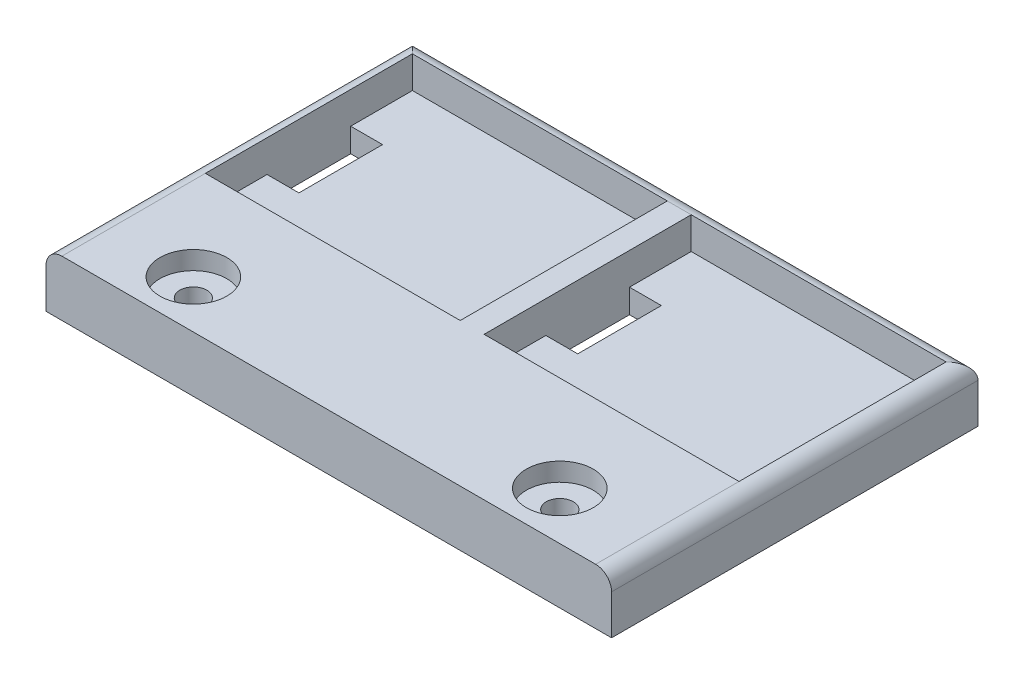
ISO-10303-21;
HEADER;
FILE_DESCRIPTION(('STEP AP214'),'2;1');
FILE_NAME('part.step','',(''),(''),'','','');
FILE_SCHEMA(('AUTOMOTIVE_DESIGN { 1 0 10303 214 1 1 1 1 }'));
ENDSEC;
DATA;
#1=APPLICATION_CONTEXT('core data for automotive mechanical design processes');
#2=APPLICATION_PROTOCOL_DEFINITION('international standard','automotive_design',2000,#1);
#3=PRODUCT_CONTEXT('',#1,'mechanical');
#4=PRODUCT('Part','Part','',(#3));
#5=PRODUCT_RELATED_PRODUCT_CATEGORY('part','',(#4));
#6=PRODUCT_DEFINITION_FORMATION('','',#4);
#7=PRODUCT_DEFINITION_CONTEXT('part definition',#1,'design');
#8=PRODUCT_DEFINITION('design','',#6,#7);
#9=PRODUCT_DEFINITION_SHAPE('','',#8);
#10=(LENGTH_UNIT() NAMED_UNIT(*) SI_UNIT(.MILLI.,.METRE.));
#11=(NAMED_UNIT(*) PLANE_ANGLE_UNIT() SI_UNIT($,.RADIAN.));
#12=(NAMED_UNIT(*) SI_UNIT($,.STERADIAN.) SOLID_ANGLE_UNIT());
#13=UNCERTAINTY_MEASURE_WITH_UNIT(LENGTH_MEASURE(1.E-05),#10,'distance_accuracy_value','');
#14=(GEOMETRIC_REPRESENTATION_CONTEXT(3) GLOBAL_UNCERTAINTY_ASSIGNED_CONTEXT((#13)) GLOBAL_UNIT_ASSIGNED_CONTEXT((#10,
#11,#12)) REPRESENTATION_CONTEXT('',''));
#15=CARTESIAN_POINT('',(0.,0.,0.));
#16=DIRECTION('',(0.,0.,1.));
#17=DIRECTION('',(1.,0.,0.));
#18=AXIS2_PLACEMENT_3D('',#15,#16,#17);
#19=CARTESIAN_POINT('',(0.,3.,0.));
#20=DIRECTION('',(0.,-1.,0.));
#21=DIRECTION('',(0.,0.,-1.));
#22=AXIS2_PLACEMENT_3D('',#19,#20,#21);
#23=PLANE('',#22);
#24=DIRECTION('',(-1.,0.,0.));
#25=VECTOR('',#24,1.);
#26=CARTESIAN_POINT('',(1.49999999999999,3.,-13.25));
#27=LINE('',#26,#25);
#28=CARTESIAN_POINT('',(5.5,3.,-13.25));
#29=VERTEX_POINT('',#28);
#30=CARTESIAN_POINT('',(1.49999999999999,3.,-13.25));
#31=VERTEX_POINT('',#30);
#32=EDGE_CURVE('E306',#29,#31,#27,.T.);
#33=ORIENTED_EDGE('',*,*,#32,.F.);
#34=DIRECTION('',(0.,0.,-1.));
#35=VECTOR('',#34,1.);
#36=CARTESIAN_POINT('',(5.5,3.,-13.25));
#37=LINE('',#36,#35);
#38=CARTESIAN_POINT('',(5.5,3.,-2.75000000000001));
#39=VERTEX_POINT('',#38);
#40=EDGE_CURVE('E293',#39,#29,#37,.T.);
#41=ORIENTED_EDGE('',*,*,#40,.F.);
#42=DIRECTION('',(1.,0.,0.));
#43=VECTOR('',#42,1.);
#44=CARTESIAN_POINT('',(1.49999999999999,3.,-2.75000000000001));
#45=LINE('',#44,#43);
#46=CARTESIAN_POINT('',(1.49999999999999,3.,-2.75000000000001));
#47=VERTEX_POINT('',#46);
#48=EDGE_CURVE('E310',#47,#39,#45,.T.);
#49=ORIENTED_EDGE('',*,*,#48,.F.);
#50=DIRECTION('',(0.,0.,-1.));
#51=VECTOR('',#50,1.);
#52=CARTESIAN_POINT('',(1.49999999999999,3.,5.));
#53=LINE('',#52,#51);
#54=CARTESIAN_POINT('',(1.49999999999999,3.,5.));
#55=VERTEX_POINT('',#54);
#56=EDGE_CURVE('E448',#55,#47,#53,.T.);
#57=ORIENTED_EDGE('',*,*,#56,.F.);
#58=DIRECTION('',(-1.,0.,0.));
#59=VECTOR('',#58,1.);
#60=CARTESIAN_POINT('',(33.5,3.,5.));
#61=LINE('',#60,#59);
#62=CARTESIAN_POINT('',(33.5,3.,5.));
#63=VERTEX_POINT('',#62);
#64=EDGE_CURVE('E452',#63,#55,#61,.T.);
#65=ORIENTED_EDGE('',*,*,#64,.F.);
#66=DIRECTION('',(0.,0.,-1.));
#67=VECTOR('',#66,1.);
#68=CARTESIAN_POINT('',(33.5,3.,5.));
#69=LINE('',#68,#67);
#70=CARTESIAN_POINT('',(33.5,3.,-2.74999999999999));
#71=VERTEX_POINT('',#70);
#72=EDGE_CURVE('E439',#63,#71,#69,.T.);
#73=ORIENTED_EDGE('',*,*,#72,.T.);
#74=DIRECTION('',(1.,0.,0.));
#75=VECTOR('',#74,1.);
#76=CARTESIAN_POINT('',(33.5,3.,-2.74999999999999));
#77=LINE('',#76,#75);
#78=CARTESIAN_POINT('',(29.5,3.,-2.74999999999999));
#79=VERTEX_POINT('',#78);
#80=EDGE_CURVE('E373',#79,#71,#77,.T.);
#81=ORIENTED_EDGE('',*,*,#80,.F.);
#82=DIRECTION('',(0.,0.,1.));
#83=VECTOR('',#82,1.);
#84=CARTESIAN_POINT('',(29.5,3.,-13.25));
#85=LINE('',#84,#83);
#86=CARTESIAN_POINT('',(29.5,3.,-13.25));
#87=VERTEX_POINT('',#86);
#88=EDGE_CURVE('E390',#87,#79,#85,.T.);
#89=ORIENTED_EDGE('',*,*,#88,.F.);
#90=DIRECTION('',(-1.,0.,0.));
#91=VECTOR('',#90,1.);
#92=CARTESIAN_POINT('',(33.5,3.,-13.25));
#93=LINE('',#92,#91);
#94=CARTESIAN_POINT('',(33.5,3.,-13.25));
#95=VERTEX_POINT('',#94);
#96=EDGE_CURVE('E386',#95,#87,#93,.T.);
#97=ORIENTED_EDGE('',*,*,#96,.F.);
#98=CARTESIAN_POINT('',(33.5,3.,-21.));
#99=VERTEX_POINT('',#98);
#100=EDGE_CURVE('E438',#95,#99,#69,.T.);
#101=ORIENTED_EDGE('',*,*,#100,.T.);
#102=DIRECTION('',(-1.,0.,0.));
#103=VECTOR('',#102,1.);
#104=CARTESIAN_POINT('',(33.5,3.,-21.));
#105=LINE('',#104,#103);
#106=CARTESIAN_POINT('',(1.49999999999999,3.,-21.));
#107=VERTEX_POINT('',#106);
#108=EDGE_CURVE('E443',#99,#107,#105,.T.);
#109=ORIENTED_EDGE('',*,*,#108,.T.);
#110=EDGE_CURVE('E447',#31,#107,#53,.T.);
#111=ORIENTED_EDGE('',*,*,#110,.F.);
#112=EDGE_LOOP('',(#33,#41,#49,#57,#65,#73,#81,#89,#97,#101,#109,#111));
#113=FACE_BOUND('',#112,.T.);
#114=ADVANCED_FACE('F39',(#113),#23,.F.);
#115=CARTESIAN_POINT('',(33.5,7.,5.));
#116=DIRECTION('',(-1.,0.,0.));
#117=DIRECTION('',(0.,0.,1.));
#118=AXIS2_PLACEMENT_3D('',#115,#116,#117);
#119=PLANE('',#118);
#120=DIRECTION('',(0.,-1.,0.));
#121=VECTOR('',#120,1.);
#122=CARTESIAN_POINT('',(33.5,7.,-21.));
#123=LINE('',#122,#121);
#124=CARTESIAN_POINT('',(33.5,7.,-21.));
#125=VERTEX_POINT('',#124);
#126=EDGE_CURVE('E498',#125,#99,#123,.T.);
#127=ORIENTED_EDGE('',*,*,#126,.T.);
#128=ORIENTED_EDGE('',*,*,#100,.F.);
#129=DIRECTION('',(0.,1.,0.));
#130=VECTOR('',#129,1.);
#131=CARTESIAN_POINT('',(33.5,-1.17093834628434E-13,-13.25));
#132=LINE('',#131,#130);
#133=CARTESIAN_POINT('',(33.5,-1.17093834628434E-13,-13.25));
#134=VERTEX_POINT('',#133);
#135=EDGE_CURVE('E385',#134,#95,#132,.T.);
#136=ORIENTED_EDGE('',*,*,#135,.F.);
#137=DIRECTION('',(0.,0.,-1.));
#138=VECTOR('',#137,1.);
#139=CARTESIAN_POINT('',(33.5,-1.17093834628434E-13,-13.25));
#140=LINE('',#139,#138);
#141=CARTESIAN_POINT('',(33.5,-1.17093834628434E-13,-2.74999999999999));
#142=VERTEX_POINT('',#141);
#143=EDGE_CURVE('E368',#142,#134,#140,.T.);
#144=ORIENTED_EDGE('',*,*,#143,.F.);
#145=DIRECTION('',(0.,1.,0.));
#146=VECTOR('',#145,1.);
#147=CARTESIAN_POINT('',(33.5,-1.17093834628434E-13,-2.74999999999999));
#148=LINE('',#147,#146);
#149=EDGE_CURVE('E351',#142,#71,#148,.T.);
#150=ORIENTED_EDGE('',*,*,#149,.T.);
#151=ORIENTED_EDGE('',*,*,#72,.F.);
#152=DIRECTION('',(0.,-1.,0.));
#153=VECTOR('',#152,1.);
#154=CARTESIAN_POINT('',(33.5,7.,5.));
#155=LINE('',#154,#153);
#156=CARTESIAN_POINT('',(33.5,7.,5.));
#157=VERTEX_POINT('',#156);
#158=EDGE_CURVE('E486',#157,#63,#155,.T.);
#159=ORIENTED_EDGE('',*,*,#158,.F.);
#160=DIRECTION('',(0.,0.,-1.));
#161=VECTOR('',#160,1.);
#162=CARTESIAN_POINT('',(33.5,7.,5.));
#163=LINE('',#162,#161);
#164=EDGE_CURVE('E472',#157,#125,#163,.T.);
#165=ORIENTED_EDGE('',*,*,#164,.T.);
#166=EDGE_LOOP('',(#127,#128,#136,#144,#150,#151,#159,#165));
#167=FACE_BOUND('',#166,.T.);
#168=ADVANCED_FACE('F644',(#167),#119,.T.);
#169=CARTESIAN_POINT('',(33.5,7.,-21.));
#170=DIRECTION('',(0.,0.,1.));
#171=DIRECTION('',(1.,0.,0.));
#172=AXIS2_PLACEMENT_3D('',#169,#170,#171);
#173=PLANE('',#172);
#174=DIRECTION('',(0.,-1.,0.));
#175=VECTOR('',#174,1.);
#176=CARTESIAN_POINT('',(1.49999999999999,7.,-21.));
#177=LINE('',#176,#175);
#178=CARTESIAN_POINT('',(1.49999999999999,7.,-21.));
#179=VERTEX_POINT('',#178);
#180=EDGE_CURVE('E494',#179,#107,#177,.T.);
#181=ORIENTED_EDGE('',*,*,#180,.T.);
#182=ORIENTED_EDGE('',*,*,#108,.F.);
#183=ORIENTED_EDGE('',*,*,#126,.F.);
#184=DIRECTION('',(-1.,0.,0.));
#185=VECTOR('',#184,1.);
#186=CARTESIAN_POINT('',(33.5,7.,-21.));
#187=LINE('',#186,#185);
#188=EDGE_CURVE('E475',#125,#179,#187,.T.);
#189=ORIENTED_EDGE('',*,*,#188,.T.);
#190=EDGE_LOOP('',(#181,#182,#183,#189));
#191=FACE_BOUND('',#190,.T.);
#192=ADVANCED_FACE('F641',(#191),#173,.T.);
#193=CARTESIAN_POINT('',(1.49999999999999,7.,5.));
#194=DIRECTION('',(1.,0.,0.));
#195=DIRECTION('',(0.,0.,-1.));
#196=AXIS2_PLACEMENT_3D('',#193,#194,#195);
#197=PLANE('',#196);
#198=DIRECTION('',(0.,-1.,0.));
#199=VECTOR('',#198,1.);
#200=CARTESIAN_POINT('',(1.49999999999999,7.,5.));
#201=LINE('',#200,#199);
#202=CARTESIAN_POINT('',(1.49999999999999,7.,5.));
#203=VERTEX_POINT('',#202);
#204=EDGE_CURVE('E490',#203,#55,#201,.T.);
#205=ORIENTED_EDGE('',*,*,#204,.T.);
#206=ORIENTED_EDGE('',*,*,#56,.T.);
#207=DIRECTION('',(0.,1.,0.));
#208=VECTOR('',#207,1.);
#209=CARTESIAN_POINT('',(1.49999999999999,-1.17093834628434E-13,-2.75000000000001));
#210=LINE('',#209,#208);
#211=CARTESIAN_POINT('',(1.49999999999999,0.,-2.75000000000001));
#212=VERTEX_POINT('',#211);
#213=EDGE_CURVE('E323',#212,#47,#210,.T.);
#214=ORIENTED_EDGE('',*,*,#213,.F.);
#215=DIRECTION('',(0.,0.,1.));
#216=VECTOR('',#215,1.);
#217=CARTESIAN_POINT('',(1.49999999999999,-1.17093834628434E-13,-13.25));
#218=LINE('',#217,#216);
#219=CARTESIAN_POINT('',(1.49999999999999,-1.17093834628434E-13,-13.25));
#220=VERTEX_POINT('',#219);
#221=EDGE_CURVE('E292',#220,#212,#218,.T.);
#222=ORIENTED_EDGE('',*,*,#221,.F.);
#223=DIRECTION('',(0.,1.,0.));
#224=VECTOR('',#223,1.);
#225=CARTESIAN_POINT('',(1.49999999999999,-1.17093834628434E-13,-13.25));
#226=LINE('',#225,#224);
#227=EDGE_CURVE('E305',#220,#31,#226,.T.);
#228=ORIENTED_EDGE('',*,*,#227,.T.);
#229=ORIENTED_EDGE('',*,*,#110,.T.);
#230=ORIENTED_EDGE('',*,*,#180,.F.);
#231=DIRECTION('',(0.,0.,1.));
#232=VECTOR('',#231,1.);
#233=CARTESIAN_POINT('',(1.49999999999999,7.,5.));
#234=LINE('',#233,#232);
#235=EDGE_CURVE('E478',#179,#203,#234,.T.);
#236=ORIENTED_EDGE('',*,*,#235,.T.);
#237=EDGE_LOOP('',(#205,#206,#214,#222,#228,#229,#230,#236));
#238=FACE_BOUND('',#237,.T.);
#239=ADVANCED_FACE('F655',(#238),#197,.T.);
#240=CARTESIAN_POINT('',(33.5,7.,5.));
#241=DIRECTION('',(0.,0.,-1.));
#242=DIRECTION('',(-1.,0.,0.));
#243=AXIS2_PLACEMENT_3D('',#240,#241,#242);
#244=PLANE('',#243);
#245=ORIENTED_EDGE('',*,*,#158,.T.);
#246=ORIENTED_EDGE('',*,*,#64,.T.);
#247=ORIENTED_EDGE('',*,*,#204,.F.);
#248=DIRECTION('',(1.,0.,0.));
#249=VECTOR('',#248,1.);
#250=CARTESIAN_POINT('',(33.5,7.,5.));
#251=LINE('',#250,#249);
#252=EDGE_CURVE('E482',#203,#157,#251,.T.);
#253=ORIENTED_EDGE('',*,*,#252,.T.);
#254=EDGE_LOOP('',(#245,#246,#247,#253));
#255=FACE_BOUND('',#254,.T.);
#256=ADVANCED_FACE('F653',(#255),#244,.T.);
#257=CARTESIAN_POINT('',(0.,7.,0.));
#258=DIRECTION('',(0.,-1.,0.));
#259=DIRECTION('',(0.,0.,-1.));
#260=AXIS2_PLACEMENT_3D('',#257,#258,#259);
#261=PLANE('',#260);
#262=CARTESIAN_POINT('',(-23.,7.,17.));
#263=DIRECTION('',(0.,1.,0.));
#264=DIRECTION('',(0.,0.,1.));
#265=AXIS2_PLACEMENT_3D('',#262,#263,#264);
#266=CIRCLE('',#265,4.2);
#267=CARTESIAN_POINT('',(-23.,7.,21.2));
#268=VERTEX_POINT('',#267);
#269=EDGE_CURVE('E281',#268,#268,#266,.T.);
#270=ORIENTED_EDGE('',*,*,#269,.F.);
#271=EDGE_LOOP('',(#270));
#272=FACE_BOUND('',#271,.T.);
#273=CARTESIAN_POINT('',(23.,7.,17.));
#274=DIRECTION('',(0.,1.,0.));
#275=DIRECTION('',(0.,0.,1.));
#276=AXIS2_PLACEMENT_3D('',#273,#274,#275);
#277=CIRCLE('',#276,4.2);
#278=CARTESIAN_POINT('',(23.,7.,21.2));
#279=VERTEX_POINT('',#278);
#280=EDGE_CURVE('E422',#279,#279,#277,.T.);
#281=ORIENTED_EDGE('',*,*,#280,.F.);
#282=EDGE_LOOP('',(#281));
#283=FACE_BOUND('',#282,.T.);
#284=DIRECTION('',(1.,0.,0.));
#285=VECTOR('',#284,1.);
#286=CARTESIAN_POINT('',(-35.5,7.,23.));
#287=LINE('',#286,#285);
#288=CARTESIAN_POINT('',(-33.5,7.,23.));
#289=VERTEX_POINT('',#288);
#290=CARTESIAN_POINT('',(33.5,7.,23.));
#291=VERTEX_POINT('',#290);
#292=EDGE_CURVE('E531',#289,#291,#287,.T.);
#293=ORIENTED_EDGE('',*,*,#292,.T.);
#294=DIRECTION('',(0.,0.,-1.));
#295=VECTOR('',#294,1.);
#296=CARTESIAN_POINT('',(33.5,7.,0.));
#297=LINE('',#296,#295);
#298=EDGE_CURVE('E568',#291,#157,#297,.T.);
#299=ORIENTED_EDGE('',*,*,#298,.T.);
#300=ORIENTED_EDGE('',*,*,#252,.F.);
#301=ORIENTED_EDGE('',*,*,#235,.F.);
#302=DIRECTION('',(-1.,0.,0.));
#303=VECTOR('',#302,1.);
#304=CARTESIAN_POINT('',(0.,7.,-21.));
#305=LINE('',#304,#303);
#306=CARTESIAN_POINT('',(-1.49999999999999,7.,-21.));
#307=VERTEX_POINT('',#306);
#308=EDGE_CURVE('E565',#179,#307,#305,.T.);
#309=ORIENTED_EDGE('',*,*,#308,.T.);
#310=DIRECTION('',(0.,0.,-1.));
#311=VECTOR('',#310,1.);
#312=CARTESIAN_POINT('',(-1.49999999999999,7.,5.));
#313=LINE('',#312,#311);
#314=CARTESIAN_POINT('',(-1.49999999999999,7.,5.));
#315=VERTEX_POINT('',#314);
#316=EDGE_CURVE('E502',#315,#307,#313,.T.);
#317=ORIENTED_EDGE('',*,*,#316,.F.);
#318=DIRECTION('',(1.,0.,0.));
#319=VECTOR('',#318,1.);
#320=CARTESIAN_POINT('',(-33.5,7.,5.));
#321=LINE('',#320,#319);
#322=CARTESIAN_POINT('',(-33.5,7.,5.));
#323=VERTEX_POINT('',#322);
#324=EDGE_CURVE('E513',#323,#315,#321,.T.);
#325=ORIENTED_EDGE('',*,*,#324,.F.);
#326=DIRECTION('',(0.,0.,1.));
#327=VECTOR('',#326,1.);
#328=CARTESIAN_POINT('',(-33.5,7.,0.));
#329=LINE('',#328,#327);
#330=EDGE_CURVE('E562',#323,#289,#329,.T.);
#331=ORIENTED_EDGE('',*,*,#330,.T.);
#332=EDGE_LOOP('',(#293,#299,#300,#301,#309,#317,#325,#331));
#333=FACE_BOUND('',#332,.T.);
#334=ADVANCED_FACE('F602',(#272,#283,#333),#261,.F.);
#335=CARTESIAN_POINT('',(0.,0.,0.));
#336=DIRECTION('',(0.,-1.,0.));
#337=DIRECTION('',(0.,0.,-1.));
#338=AXIS2_PLACEMENT_3D('',#335,#336,#337);
#339=PLANE('',#338);
#340=DIRECTION('',(0.,0.,1.));
#341=VECTOR('',#340,1.);
#342=CARTESIAN_POINT('',(-33.5,-1.17093834628434E-13,-13.25));
#343=LINE('',#342,#341);
#344=CARTESIAN_POINT('',(-33.5,-1.17093834628434E-13,-13.25));
#345=VERTEX_POINT('',#344);
#346=CARTESIAN_POINT('',(-33.5,-1.17093834628434E-13,-2.74999999999999));
#347=VERTEX_POINT('',#346);
#348=EDGE_CURVE('E236',#345,#347,#343,.T.);
#349=ORIENTED_EDGE('',*,*,#348,.T.);
#350=DIRECTION('',(1.,0.,0.));
#351=VECTOR('',#350,1.);
#352=CARTESIAN_POINT('',(-33.5,-1.17093834628434E-13,-2.74999999999999));
#353=LINE('',#352,#351);
#354=CARTESIAN_POINT('',(-29.5,0.,-2.74999999999999));
#355=VERTEX_POINT('',#354);
#356=EDGE_CURVE('E250',#347,#355,#353,.T.);
#357=ORIENTED_EDGE('',*,*,#356,.T.);
#358=DIRECTION('',(0.,0.,-1.));
#359=VECTOR('',#358,1.);
#360=CARTESIAN_POINT('',(-29.5,-1.17093834628434E-13,-13.25));
#361=LINE('',#360,#359);
#362=CARTESIAN_POINT('',(-29.5,-1.17093834628434E-13,-13.25));
#363=VERTEX_POINT('',#362);
#364=EDGE_CURVE('E255',#355,#363,#361,.T.);
#365=ORIENTED_EDGE('',*,*,#364,.T.);
#366=DIRECTION('',(-1.,0.,0.));
#367=VECTOR('',#366,1.);
#368=CARTESIAN_POINT('',(-33.5,-1.17093834628434E-13,-13.25));
#369=LINE('',#368,#367);
#370=EDGE_CURVE('E246',#363,#345,#369,.T.);
#371=ORIENTED_EDGE('',*,*,#370,.T.);
#372=EDGE_LOOP('',(#349,#357,#365,#371));
#373=FACE_BOUND('',#372,.T.);
#374=DIRECTION('',(-1.,0.,0.));
#375=VECTOR('',#374,1.);
#376=CARTESIAN_POINT('',(1.49999999999999,-1.17093834628434E-13,-13.25));
#377=LINE('',#376,#375);
#378=CARTESIAN_POINT('',(5.5,-1.17093834628434E-13,-13.25));
#379=VERTEX_POINT('',#378);
#380=EDGE_CURVE('E288',#379,#220,#377,.T.);
#381=ORIENTED_EDGE('',*,*,#380,.T.);
#382=ORIENTED_EDGE('',*,*,#221,.T.);
#383=DIRECTION('',(1.,0.,0.));
#384=VECTOR('',#383,1.);
#385=CARTESIAN_POINT('',(1.49999999999999,-1.17093834628434E-13,-2.75000000000001));
#386=LINE('',#385,#384);
#387=CARTESIAN_POINT('',(5.5,-1.17093834628434E-13,-2.75000000000001));
#388=VERTEX_POINT('',#387);
#389=EDGE_CURVE('E297',#212,#388,#386,.T.);
#390=ORIENTED_EDGE('',*,*,#389,.T.);
#391=DIRECTION('',(0.,0.,-1.));
#392=VECTOR('',#391,1.);
#393=CARTESIAN_POINT('',(5.5,-1.17093834628434E-13,-13.25));
#394=LINE('',#393,#392);
#395=EDGE_CURVE('E301',#388,#379,#394,.T.);
#396=ORIENTED_EDGE('',*,*,#395,.T.);
#397=EDGE_LOOP('',(#381,#382,#390,#396));
#398=FACE_BOUND('',#397,.T.);
#399=DIRECTION('',(0.,0.,-1.));
#400=VECTOR('',#399,1.);
#401=CARTESIAN_POINT('',(-1.49999999999999,-1.17093834628434E-13,-13.25));
#402=LINE('',#401,#400);
#403=CARTESIAN_POINT('',(-1.49999999999999,-1.17093834628434E-13,-2.75000000000001));
#404=VERTEX_POINT('',#403);
#405=CARTESIAN_POINT('',(-1.49999999999999,-1.17093834628434E-13,-13.25));
#406=VERTEX_POINT('',#405);
#407=EDGE_CURVE('E328',#404,#406,#402,.T.);
#408=ORIENTED_EDGE('',*,*,#407,.T.);
#409=DIRECTION('',(-1.,0.,0.));
#410=VECTOR('',#409,1.);
#411=CARTESIAN_POINT('',(-1.49999999999999,-1.17093834628434E-13,-13.25));
#412=LINE('',#411,#410);
#413=CARTESIAN_POINT('',(-5.5,0.,-13.25));
#414=VERTEX_POINT('',#413);
#415=EDGE_CURVE('E332',#406,#414,#412,.T.);
#416=ORIENTED_EDGE('',*,*,#415,.T.);
#417=DIRECTION('',(0.,0.,1.));
#418=VECTOR('',#417,1.);
#419=CARTESIAN_POINT('',(-5.5,-1.17093834628434E-13,-13.25));
#420=LINE('',#419,#418);
#421=CARTESIAN_POINT('',(-5.5,-1.17093834628434E-13,-2.75000000000001));
#422=VERTEX_POINT('',#421);
#423=EDGE_CURVE('E337',#414,#422,#420,.T.);
#424=ORIENTED_EDGE('',*,*,#423,.T.);
#425=DIRECTION('',(1.,0.,0.));
#426=VECTOR('',#425,1.);
#427=CARTESIAN_POINT('',(-1.49999999999999,-1.17093834628434E-13,-2.75000000000001));
#428=LINE('',#427,#426);
#429=EDGE_CURVE('E341',#422,#404,#428,.T.);
#430=ORIENTED_EDGE('',*,*,#429,.T.);
#431=EDGE_LOOP('',(#408,#416,#424,#430));
#432=FACE_BOUND('',#431,.T.);
#433=ORIENTED_EDGE('',*,*,#143,.T.);
#434=DIRECTION('',(-1.,0.,0.));
#435=VECTOR('',#434,1.);
#436=CARTESIAN_POINT('',(33.5,-1.17093834628434E-13,-13.25));
#437=LINE('',#436,#435);
#438=CARTESIAN_POINT('',(29.5,0.,-13.25));
#439=VERTEX_POINT('',#438);
#440=EDGE_CURVE('E372',#134,#439,#437,.T.);
#441=ORIENTED_EDGE('',*,*,#440,.T.);
#442=DIRECTION('',(0.,0.,1.));
#443=VECTOR('',#442,1.);
#444=CARTESIAN_POINT('',(29.5,-1.17093834628434E-13,-13.25));
#445=LINE('',#444,#443);
#446=CARTESIAN_POINT('',(29.5,-1.17093834628434E-13,-2.74999999999999));
#447=VERTEX_POINT('',#446);
#448=EDGE_CURVE('E377',#439,#447,#445,.T.);
#449=ORIENTED_EDGE('',*,*,#448,.T.);
#450=DIRECTION('',(1.,0.,0.));
#451=VECTOR('',#450,1.);
#452=CARTESIAN_POINT('',(33.5,-1.17093834628434E-13,-2.74999999999999));
#453=LINE('',#452,#451);
#454=EDGE_CURVE('E381',#447,#142,#453,.T.);
#455=ORIENTED_EDGE('',*,*,#454,.T.);
#456=EDGE_LOOP('',(#433,#441,#449,#455));
#457=FACE_BOUND('',#456,.T.);
#458=CARTESIAN_POINT('',(-23.,-1.17093834628434E-13,17.));
#459=DIRECTION('',(0.,1.,0.));
#460=DIRECTION('',(0.,0.,1.));
#461=AXIS2_PLACEMENT_3D('',#458,#459,#460);
#462=CIRCLE('',#461,1.70000000000027);
#463=CARTESIAN_POINT('',(-23.,-1.17093834628434E-13,18.7000000000003));
#464=VERTEX_POINT('',#463);
#465=EDGE_CURVE('E418',#464,#464,#462,.T.);
#466=ORIENTED_EDGE('',*,*,#465,.T.);
#467=EDGE_LOOP('',(#466));
#468=FACE_BOUND('',#467,.T.);
#469=CARTESIAN_POINT('',(23.,-1.17093834628434E-13,17.));
#470=DIRECTION('',(0.,1.,0.));
#471=DIRECTION('',(0.,0.,1.));
#472=AXIS2_PLACEMENT_3D('',#469,#470,#471);
#473=CIRCLE('',#472,1.70000000000027);
#474=CARTESIAN_POINT('',(23.,-1.17093834628434E-13,18.7000000000003));
#475=VERTEX_POINT('',#474);
#476=EDGE_CURVE('E434',#475,#475,#473,.T.);
#477=ORIENTED_EDGE('',*,*,#476,.T.);
#478=EDGE_LOOP('',(#477));
#479=FACE_BOUND('',#478,.T.);
#480=DIRECTION('',(0.,0.,-1.));
#481=VECTOR('',#480,1.);
#482=CARTESIAN_POINT('',(35.5,0.,23.));
#483=LINE('',#482,#481);
#484=CARTESIAN_POINT('',(35.5,0.,23.));
#485=VERTEX_POINT('',#484);
#486=CARTESIAN_POINT('',(35.5,0.,-23.));
#487=VERTEX_POINT('',#486);
#488=EDGE_CURVE('E530',#485,#487,#483,.T.);
#489=ORIENTED_EDGE('',*,*,#488,.F.);
#490=DIRECTION('',(1.,0.,0.));
#491=VECTOR('',#490,1.);
#492=CARTESIAN_POINT('',(-35.5,0.,23.));
#493=LINE('',#492,#491);
#494=CARTESIAN_POINT('',(-35.5,0.,23.));
#495=VERTEX_POINT('',#494);
#496=EDGE_CURVE('E536',#495,#485,#493,.T.);
#497=ORIENTED_EDGE('',*,*,#496,.F.);
#498=DIRECTION('',(0.,0.,1.));
#499=VECTOR('',#498,1.);
#500=CARTESIAN_POINT('',(-35.5,0.,23.));
#501=LINE('',#500,#499);
#502=CARTESIAN_POINT('',(-35.5,0.,-23.));
#503=VERTEX_POINT('',#502);
#504=EDGE_CURVE('E544',#503,#495,#501,.T.);
#505=ORIENTED_EDGE('',*,*,#504,.F.);
#506=DIRECTION('',(-1.,0.,0.));
#507=VECTOR('',#506,1.);
#508=CARTESIAN_POINT('',(-35.5,0.,-23.));
#509=LINE('',#508,#507);
#510=EDGE_CURVE('E540',#487,#503,#509,.T.);
#511=ORIENTED_EDGE('',*,*,#510,.F.);
#512=EDGE_LOOP('',(#489,#497,#505,#511));
#513=FACE_BOUND('',#512,.T.);
#514=ADVANCED_FACE('F257',(#373,#398,#432,#457,#468,#479,#513),#339,.T.);
#515=CARTESIAN_POINT('',(35.5,7.,23.));
#516=DIRECTION('',(-1.,0.,0.));
#517=DIRECTION('',(0.,0.,1.));
#518=AXIS2_PLACEMENT_3D('',#515,#516,#517);
#519=PLANE('',#518);
#520=DIRECTION('',(0.,-1.,0.));
#521=VECTOR('',#520,1.);
#522=CARTESIAN_POINT('',(35.5,7.,-23.));
#523=LINE('',#522,#521);
#524=CARTESIAN_POINT('',(35.5,5.,-23.));
#525=VERTEX_POINT('',#524);
#526=EDGE_CURVE('E559',#525,#487,#523,.T.);
#527=ORIENTED_EDGE('',*,*,#526,.F.);
#528=DIRECTION('',(0.,0.,-1.));
#529=VECTOR('',#528,1.);
#530=CARTESIAN_POINT('',(35.5,5.,23.));
#531=LINE('',#530,#529);
#532=CARTESIAN_POINT('',(35.5,5.,23.));
#533=VERTEX_POINT('',#532);
#534=EDGE_CURVE('E572',#525,#533,#531,.F.);
#535=ORIENTED_EDGE('',*,*,#534,.T.);
#536=DIRECTION('',(0.,-1.,0.));
#537=VECTOR('',#536,1.);
#538=CARTESIAN_POINT('',(35.5,7.,23.));
#539=LINE('',#538,#537);
#540=EDGE_CURVE('E535',#533,#485,#539,.T.);
#541=ORIENTED_EDGE('',*,*,#540,.T.);
#542=ORIENTED_EDGE('',*,*,#488,.T.);
#543=EDGE_LOOP('',(#527,#535,#541,#542));
#544=FACE_BOUND('',#543,.T.);
#545=ADVANCED_FACE('F670',(#544),#519,.F.);
#546=CARTESIAN_POINT('',(-35.5,7.,-23.));
#547=DIRECTION('',(0.,0.,1.));
#548=DIRECTION('',(1.,0.,0.));
#549=AXIS2_PLACEMENT_3D('',#546,#547,#548);
#550=PLANE('',#549);
#551=DIRECTION('',(0.,-1.,0.));
#552=VECTOR('',#551,1.);
#553=CARTESIAN_POINT('',(-35.5,7.,-23.));
#554=LINE('',#553,#552);
#555=CARTESIAN_POINT('',(-35.5,5.,-23.));
#556=VERTEX_POINT('',#555);
#557=EDGE_CURVE('E556',#556,#503,#554,.T.);
#558=ORIENTED_EDGE('',*,*,#557,.F.);
#559=DIRECTION('',(-1.,0.,0.));
#560=VECTOR('',#559,1.);
#561=CARTESIAN_POINT('',(-35.5,5.,-23.));
#562=LINE('',#561,#560);
#563=EDGE_CURVE('E49',#556,#525,#562,.F.);
#564=ORIENTED_EDGE('',*,*,#563,.T.);
#565=ORIENTED_EDGE('',*,*,#526,.T.);
#566=ORIENTED_EDGE('',*,*,#510,.T.);
#567=EDGE_LOOP('',(#558,#564,#565,#566));
#568=FACE_BOUND('',#567,.T.);
#569=ADVANCED_FACE('F689',(#568),#550,.F.);
#570=CARTESIAN_POINT('',(-35.5,7.,23.));
#571=DIRECTION('',(1.,0.,0.));
#572=DIRECTION('',(0.,0.,-1.));
#573=AXIS2_PLACEMENT_3D('',#570,#571,#572);
#574=PLANE('',#573);
#575=DIRECTION('',(0.,-1.,0.));
#576=VECTOR('',#575,1.);
#577=CARTESIAN_POINT('',(-35.5,7.,23.));
#578=LINE('',#577,#576);
#579=CARTESIAN_POINT('',(-35.5,5.,23.));
#580=VERTEX_POINT('',#579);
#581=EDGE_CURVE('E553',#580,#495,#578,.T.);
#582=ORIENTED_EDGE('',*,*,#581,.F.);
#583=DIRECTION('',(0.,0.,1.));
#584=VECTOR('',#583,1.);
#585=CARTESIAN_POINT('',(-35.5,5.,23.));
#586=LINE('',#585,#584);
#587=EDGE_CURVE('E11',#580,#556,#586,.F.);
#588=ORIENTED_EDGE('',*,*,#587,.T.);
#589=ORIENTED_EDGE('',*,*,#557,.T.);
#590=ORIENTED_EDGE('',*,*,#504,.T.);
#591=EDGE_LOOP('',(#582,#588,#589,#590));
#592=FACE_BOUND('',#591,.T.);
#593=ADVANCED_FACE('F687',(#592),#574,.F.);
#594=CARTESIAN_POINT('',(-35.5,7.,23.));
#595=DIRECTION('',(0.,0.,-1.));
#596=DIRECTION('',(-1.,0.,0.));
#597=AXIS2_PLACEMENT_3D('',#594,#595,#596);
#598=PLANE('',#597);
#599=ORIENTED_EDGE('',*,*,#540,.F.);
#600=CARTESIAN_POINT('',(33.5,5.,23.));
#601=DIRECTION('',(0.,0.,-1.));
#602=DIRECTION('',(-1.,0.,0.));
#603=AXIS2_PLACEMENT_3D('',#600,#601,#602);
#604=CIRCLE('',#603,2.);
#605=EDGE_CURVE('E577',#533,#291,#604,.F.);
#606=ORIENTED_EDGE('',*,*,#605,.T.);
#607=ORIENTED_EDGE('',*,*,#292,.F.);
#608=CARTESIAN_POINT('',(-33.5,5.,23.));
#609=DIRECTION('',(0.,0.,-1.));
#610=DIRECTION('',(-1.,0.,0.));
#611=AXIS2_PLACEMENT_3D('',#608,#609,#610);
#612=CIRCLE('',#611,2.);
#613=EDGE_CURVE('E63',#289,#580,#612,.F.);
#614=ORIENTED_EDGE('',*,*,#613,.T.);
#615=ORIENTED_EDGE('',*,*,#581,.T.);
#616=ORIENTED_EDGE('',*,*,#496,.T.);
#617=EDGE_LOOP('',(#599,#606,#607,#614,#615,#616));
#618=FACE_BOUND('',#617,.T.);
#619=ADVANCED_FACE('F686',(#618),#598,.F.);
#620=CARTESIAN_POINT('',(-1.49999999999999,7.,5.));
#621=DIRECTION('',(-1.,0.,0.));
#622=DIRECTION('',(0.,0.,1.));
#623=AXIS2_PLACEMENT_3D('',#620,#621,#622);
#624=PLANE('',#623);
#625=DIRECTION('',(0.,0.,-1.));
#626=VECTOR('',#625,1.);
#627=CARTESIAN_POINT('',(-1.49999999999999,3.,0.));
#628=LINE('',#627,#626);
#629=CARTESIAN_POINT('',(-1.49999999999999,3.,5.));
#630=VERTEX_POINT('',#629);
#631=CARTESIAN_POINT('',(-1.49999999999999,3.,-2.75000000000001));
#632=VERTEX_POINT('',#631);
#633=EDGE_CURVE('E461',#630,#632,#628,.T.);
#634=ORIENTED_EDGE('',*,*,#633,.F.);
#635=DIRECTION('',(0.,-1.,0.));
#636=VECTOR('',#635,1.);
#637=CARTESIAN_POINT('',(-1.49999999999999,7.,5.));
#638=LINE('',#637,#636);
#639=EDGE_CURVE('E516',#315,#630,#638,.T.);
#640=ORIENTED_EDGE('',*,*,#639,.F.);
#641=ORIENTED_EDGE('',*,*,#316,.T.);
#642=DIRECTION('',(0.,-1.,0.));
#643=VECTOR('',#642,1.);
#644=CARTESIAN_POINT('',(-1.49999999999999,7.,-21.));
#645=LINE('',#644,#643);
#646=CARTESIAN_POINT('',(-1.49999999999999,3.,-21.));
#647=VERTEX_POINT('',#646);
#648=EDGE_CURVE('E526',#307,#647,#645,.T.);
#649=ORIENTED_EDGE('',*,*,#648,.T.);
#650=CARTESIAN_POINT('',(-1.49999999999999,3.,-13.25));
#651=VERTEX_POINT('',#650);
#652=EDGE_CURVE('E460',#651,#647,#628,.T.);
#653=ORIENTED_EDGE('',*,*,#652,.F.);
#654=DIRECTION('',(0.,1.,0.));
#655=VECTOR('',#654,1.);
#656=CARTESIAN_POINT('',(-1.49999999999999,-1.17093834628434E-13,-13.25));
#657=LINE('',#656,#655);
#658=EDGE_CURVE('E345',#406,#651,#657,.T.);
#659=ORIENTED_EDGE('',*,*,#658,.F.);
#660=ORIENTED_EDGE('',*,*,#407,.F.);
#661=DIRECTION('',(0.,1.,0.));
#662=VECTOR('',#661,1.);
#663=CARTESIAN_POINT('',(-1.49999999999999,-1.17093834628434E-13,-2.75000000000001));
#664=LINE('',#663,#662);
#665=EDGE_CURVE('E311',#404,#632,#664,.T.);
#666=ORIENTED_EDGE('',*,*,#665,.T.);
#667=EDGE_LOOP('',(#634,#640,#641,#649,#653,#659,#660,#666));
#668=FACE_BOUND('',#667,.T.);
#669=ADVANCED_FACE('F608',(#668),#624,.T.);
#670=CARTESIAN_POINT('',(-33.5,7.,-21.));
#671=DIRECTION('',(0.,0.,1.));
#672=DIRECTION('',(1.,0.,0.));
#673=AXIS2_PLACEMENT_3D('',#670,#671,#672);
#674=PLANE('',#673);
#675=DIRECTION('',(1.,0.,0.));
#676=VECTOR('',#675,1.);
#677=CARTESIAN_POINT('',(0.,3.,-21.));
#678=LINE('',#677,#676);
#679=CARTESIAN_POINT('',(-33.5,3.,-21.));
#680=VERTEX_POINT('',#679);
#681=EDGE_CURVE('E465',#680,#647,#678,.T.);
#682=ORIENTED_EDGE('',*,*,#681,.T.);
#683=ORIENTED_EDGE('',*,*,#648,.F.);
#684=DIRECTION('',(-1.,0.,0.));
#685=VECTOR('',#684,1.);
#686=CARTESIAN_POINT('',(-33.5,7.,-21.));
#687=LINE('',#686,#685);
#688=CARTESIAN_POINT('',(-33.5,7.,-21.));
#689=VERTEX_POINT('',#688);
#690=EDGE_CURVE('E506',#307,#689,#687,.T.);
#691=ORIENTED_EDGE('',*,*,#690,.T.);
#692=DIRECTION('',(0.,-1.,0.));
#693=VECTOR('',#692,1.);
#694=CARTESIAN_POINT('',(-33.5,7.,-21.));
#695=LINE('',#694,#693);
#696=EDGE_CURVE('E522',#689,#680,#695,.T.);
#697=ORIENTED_EDGE('',*,*,#696,.T.);
#698=EDGE_LOOP('',(#682,#683,#691,#697));
#699=FACE_BOUND('',#698,.T.);
#700=ADVANCED_FACE('F624',(#699),#674,.T.);
#701=CARTESIAN_POINT('',(-33.5,7.,5.));
#702=DIRECTION('',(1.,0.,0.));
#703=DIRECTION('',(0.,0.,-1.));
#704=AXIS2_PLACEMENT_3D('',#701,#702,#703);
#705=PLANE('',#704);
#706=DIRECTION('',(0.,0.,-1.));
#707=VECTOR('',#706,1.);
#708=CARTESIAN_POINT('',(-33.5,3.,0.));
#709=LINE('',#708,#707);
#710=CARTESIAN_POINT('',(-33.5,3.,5.));
#711=VERTEX_POINT('',#710);
#712=CARTESIAN_POINT('',(-33.5,3.,-2.74999999999999));
#713=VERTEX_POINT('',#712);
#714=EDGE_CURVE('E240',#711,#713,#709,.T.);
#715=ORIENTED_EDGE('',*,*,#714,.T.);
#716=DIRECTION('',(0.,1.,0.));
#717=VECTOR('',#716,1.);
#718=CARTESIAN_POINT('',(-33.5,-1.17093834628434E-13,-2.74999999999999));
#719=LINE('',#718,#717);
#720=EDGE_CURVE('E232',#347,#713,#719,.T.);
#721=ORIENTED_EDGE('',*,*,#720,.F.);
#722=ORIENTED_EDGE('',*,*,#348,.F.);
#723=DIRECTION('',(0.,1.,0.));
#724=VECTOR('',#723,1.);
#725=CARTESIAN_POINT('',(-33.5,-1.17093834628434E-13,-13.25));
#726=LINE('',#725,#724);
#727=CARTESIAN_POINT('',(-33.5,3.,-13.25));
#728=VERTEX_POINT('',#727);
#729=EDGE_CURVE('E278',#345,#728,#726,.T.);
#730=ORIENTED_EDGE('',*,*,#729,.T.);
#731=EDGE_CURVE('E469',#728,#680,#709,.T.);
#732=ORIENTED_EDGE('',*,*,#731,.T.);
#733=ORIENTED_EDGE('',*,*,#696,.F.);
#734=DIRECTION('',(0.,0.,1.));
#735=VECTOR('',#734,1.);
#736=CARTESIAN_POINT('',(-33.5,7.,5.));
#737=LINE('',#736,#735);
#738=EDGE_CURVE('E509',#689,#323,#737,.T.);
#739=ORIENTED_EDGE('',*,*,#738,.T.);
#740=DIRECTION('',(0.,-1.,0.));
#741=VECTOR('',#740,1.);
#742=CARTESIAN_POINT('',(-33.5,7.,5.));
#743=LINE('',#742,#741);
#744=EDGE_CURVE('E519',#323,#711,#743,.T.);
#745=ORIENTED_EDGE('',*,*,#744,.T.);
#746=EDGE_LOOP('',(#715,#721,#722,#730,#732,#733,#739,#745));
#747=FACE_BOUND('',#746,.T.);
#748=ADVANCED_FACE('F234',(#747),#705,.T.);
#749=CARTESIAN_POINT('',(-33.5,7.,5.));
#750=DIRECTION('',(0.,0.,-1.));
#751=DIRECTION('',(-1.,0.,0.));
#752=AXIS2_PLACEMENT_3D('',#749,#750,#751);
#753=PLANE('',#752);
#754=DIRECTION('',(1.,0.,0.));
#755=VECTOR('',#754,1.);
#756=CARTESIAN_POINT('',(0.,3.,5.));
#757=LINE('',#756,#755);
#758=EDGE_CURVE('E456',#711,#630,#757,.T.);
#759=ORIENTED_EDGE('',*,*,#758,.F.);
#760=ORIENTED_EDGE('',*,*,#744,.F.);
#761=ORIENTED_EDGE('',*,*,#324,.T.);
#762=ORIENTED_EDGE('',*,*,#639,.T.);
#763=EDGE_LOOP('',(#759,#760,#761,#762));
#764=FACE_BOUND('',#763,.T.);
#765=ADVANCED_FACE('F605',(#764),#753,.T.);
#766=CARTESIAN_POINT('',(0.,3.,0.));
#767=DIRECTION('',(0.,1.,0.));
#768=DIRECTION('',(0.,0.,1.));
#769=AXIS2_PLACEMENT_3D('',#766,#767,#768);
#770=PLANE('',#769);
#771=DIRECTION('',(1.,0.,0.));
#772=VECTOR('',#771,1.);
#773=CARTESIAN_POINT('',(-33.5,3.,-2.74999999999999));
#774=LINE('',#773,#772);
#775=CARTESIAN_POINT('',(-29.5,3.,-2.74999999999999));
#776=VERTEX_POINT('',#775);
#777=EDGE_CURVE('E272',#713,#776,#774,.T.);
#778=ORIENTED_EDGE('',*,*,#777,.F.);
#779=ORIENTED_EDGE('',*,*,#714,.F.);
#780=ORIENTED_EDGE('',*,*,#758,.T.);
#781=ORIENTED_EDGE('',*,*,#633,.T.);
#782=DIRECTION('',(1.,0.,0.));
#783=VECTOR('',#782,1.);
#784=CARTESIAN_POINT('',(-1.49999999999999,3.,-2.75000000000001));
#785=LINE('',#784,#783);
#786=CARTESIAN_POINT('',(-5.5,3.,-2.75000000000001));
#787=VERTEX_POINT('',#786);
#788=EDGE_CURVE('E333',#787,#632,#785,.T.);
#789=ORIENTED_EDGE('',*,*,#788,.F.);
#790=DIRECTION('',(0.,0.,1.));
#791=VECTOR('',#790,1.);
#792=CARTESIAN_POINT('',(-5.5,3.,-13.25));
#793=LINE('',#792,#791);
#794=CARTESIAN_POINT('',(-5.5,3.,-13.25));
#795=VERTEX_POINT('',#794);
#796=EDGE_CURVE('E350',#795,#787,#793,.T.);
#797=ORIENTED_EDGE('',*,*,#796,.F.);
#798=DIRECTION('',(-1.,0.,0.));
#799=VECTOR('',#798,1.);
#800=CARTESIAN_POINT('',(-1.49999999999999,3.,-13.25));
#801=LINE('',#800,#799);
#802=EDGE_CURVE('E346',#651,#795,#801,.T.);
#803=ORIENTED_EDGE('',*,*,#802,.F.);
#804=ORIENTED_EDGE('',*,*,#652,.T.);
#805=ORIENTED_EDGE('',*,*,#681,.F.);
#806=ORIENTED_EDGE('',*,*,#731,.F.);
#807=DIRECTION('',(-1.,0.,0.));
#808=VECTOR('',#807,1.);
#809=CARTESIAN_POINT('',(-33.5,3.,-13.25));
#810=LINE('',#809,#808);
#811=CARTESIAN_POINT('',(-29.5,3.,-13.25));
#812=VERTEX_POINT('',#811);
#813=EDGE_CURVE('E261',#812,#728,#810,.T.);
#814=ORIENTED_EDGE('',*,*,#813,.F.);
#815=DIRECTION('',(0.,0.,-1.));
#816=VECTOR('',#815,1.);
#817=CARTESIAN_POINT('',(-29.5,3.,-13.25));
#818=LINE('',#817,#816);
#819=EDGE_CURVE('E265',#776,#812,#818,.T.);
#820=ORIENTED_EDGE('',*,*,#819,.F.);
#821=EDGE_LOOP('',(#778,#779,#780,#781,#789,#797,#803,#804,#805,#806,#814,#820));
#822=FACE_BOUND('',#821,.T.);
#823=ADVANCED_FACE('F613',(#822),#770,.T.);
#824=CARTESIAN_POINT('',(23.,7.,17.));
#825=DIRECTION('',(0.,1.,0.));
#826=DIRECTION('',(0.,0.,1.));
#827=AXIS2_PLACEMENT_3D('',#824,#825,#826);
#828=CYLINDRICAL_SURFACE('',#827,1.70000000000027);
#829=ORIENTED_EDGE('',*,*,#476,.F.);
#830=EDGE_LOOP('',(#829));
#831=FACE_BOUND('',#830,.T.);
#832=CARTESIAN_POINT('',(23.,4.7,17.));
#833=DIRECTION('',(0.,1.,0.));
#834=DIRECTION('',(0.,0.,1.));
#835=AXIS2_PLACEMENT_3D('',#832,#833,#834);
#836=CIRCLE('',#835,1.70000000000027);
#837=CARTESIAN_POINT('',(23.,4.7,18.7000000000003));
#838=VERTEX_POINT('',#837);
#839=EDGE_CURVE('E430',#838,#838,#836,.T.);
#840=ORIENTED_EDGE('',*,*,#839,.T.);
#841=EDGE_LOOP('',(#840));
#842=FACE_BOUND('',#841,.T.);
#843=ADVANCED_FACE('F706',(#831,#842),#828,.F.);
#844=CARTESIAN_POINT('',(24.7000000000003,4.7,17.));
#845=DIRECTION('',(0.,-1.,0.));
#846=DIRECTION('',(0.,0.,-1.));
#847=AXIS2_PLACEMENT_3D('',#844,#845,#846);
#848=PLANE('',#847);
#849=ORIENTED_EDGE('',*,*,#839,.F.);
#850=EDGE_LOOP('',(#849));
#851=FACE_BOUND('',#850,.T.);
#852=CARTESIAN_POINT('',(23.,4.7,17.));
#853=DIRECTION('',(0.,1.,0.));
#854=DIRECTION('',(0.,0.,1.));
#855=AXIS2_PLACEMENT_3D('',#852,#853,#854);
#856=CIRCLE('',#855,4.2);
#857=CARTESIAN_POINT('',(23.,4.7,21.2));
#858=VERTEX_POINT('',#857);
#859=EDGE_CURVE('E426',#858,#858,#856,.T.);
#860=ORIENTED_EDGE('',*,*,#859,.T.);
#861=EDGE_LOOP('',(#860));
#862=FACE_BOUND('',#861,.T.);
#863=ADVANCED_FACE('F761',(#851,#862),#848,.F.);
#864=CARTESIAN_POINT('',(23.,7.,17.));
#865=DIRECTION('',(0.,1.,0.));
#866=DIRECTION('',(0.,0.,1.));
#867=AXIS2_PLACEMENT_3D('',#864,#865,#866);
#868=CYLINDRICAL_SURFACE('',#867,4.2);
#869=ORIENTED_EDGE('',*,*,#859,.F.);
#870=EDGE_LOOP('',(#869));
#871=FACE_BOUND('',#870,.T.);
#872=ORIENTED_EDGE('',*,*,#280,.T.);
#873=EDGE_LOOP('',(#872));
#874=FACE_BOUND('',#873,.T.);
#875=ADVANCED_FACE('F768',(#871,#874),#868,.F.);
#876=CARTESIAN_POINT('',(-23.,7.,17.));
#877=DIRECTION('',(0.,1.,0.));
#878=DIRECTION('',(0.,0.,1.));
#879=AXIS2_PLACEMENT_3D('',#876,#877,#878);
#880=CYLINDRICAL_SURFACE('',#879,1.70000000000027);
#881=ORIENTED_EDGE('',*,*,#465,.F.);
#882=EDGE_LOOP('',(#881));
#883=FACE_BOUND('',#882,.T.);
#884=CARTESIAN_POINT('',(-23.,4.7,17.));
#885=DIRECTION('',(0.,1.,0.));
#886=DIRECTION('',(0.,0.,1.));
#887=AXIS2_PLACEMENT_3D('',#884,#885,#886);
#888=CIRCLE('',#887,1.70000000000027);
#889=CARTESIAN_POINT('',(-23.,4.7,18.7000000000003));
#890=VERTEX_POINT('',#889);
#891=EDGE_CURVE('E414',#890,#890,#888,.T.);
#892=ORIENTED_EDGE('',*,*,#891,.T.);
#893=EDGE_LOOP('',(#892));
#894=FACE_BOUND('',#893,.T.);
#895=ADVANCED_FACE('F775',(#883,#894),#880,.F.);
#896=CARTESIAN_POINT('',(-21.2999999999997,4.7,17.));
#897=DIRECTION('',(0.,-1.,0.));
#898=DIRECTION('',(0.,0.,-1.));
#899=AXIS2_PLACEMENT_3D('',#896,#897,#898);
#900=PLANE('',#899);
#901=ORIENTED_EDGE('',*,*,#891,.F.);
#902=EDGE_LOOP('',(#901));
#903=FACE_BOUND('',#902,.T.);
#904=CARTESIAN_POINT('',(-23.,4.7,17.));
#905=DIRECTION('',(0.,1.,0.));
#906=DIRECTION('',(0.,0.,1.));
#907=AXIS2_PLACEMENT_3D('',#904,#905,#906);
#908=CIRCLE('',#907,4.2);
#909=CARTESIAN_POINT('',(-23.,4.7,21.2));
#910=VERTEX_POINT('',#909);
#911=EDGE_CURVE('E410',#910,#910,#908,.T.);
#912=ORIENTED_EDGE('',*,*,#911,.T.);
#913=EDGE_LOOP('',(#912));
#914=FACE_BOUND('',#913,.T.);
#915=ADVANCED_FACE('F783',(#903,#914),#900,.F.);
#916=CARTESIAN_POINT('',(-23.,7.,17.));
#917=DIRECTION('',(0.,1.,0.));
#918=DIRECTION('',(0.,0.,1.));
#919=AXIS2_PLACEMENT_3D('',#916,#917,#918);
#920=CYLINDRICAL_SURFACE('',#919,4.2);
#921=ORIENTED_EDGE('',*,*,#911,.F.);
#922=EDGE_LOOP('',(#921));
#923=FACE_BOUND('',#922,.T.);
#924=ORIENTED_EDGE('',*,*,#269,.T.);
#925=EDGE_LOOP('',(#924));
#926=FACE_BOUND('',#925,.T.);
#927=ADVANCED_FACE('F791',(#923,#926),#920,.F.);
#928=CARTESIAN_POINT('',(33.5,-1.17093834628434E-13,-2.74999999999999));
#929=DIRECTION('',(0.,0.,1.));
#930=DIRECTION('',(1.,0.,0.));
#931=AXIS2_PLACEMENT_3D('',#928,#929,#930);
#932=PLANE('',#931);
#933=ORIENTED_EDGE('',*,*,#80,.T.);
#934=ORIENTED_EDGE('',*,*,#149,.F.);
#935=ORIENTED_EDGE('',*,*,#454,.F.);
#936=DIRECTION('',(0.,1.,0.));
#937=VECTOR('',#936,1.);
#938=CARTESIAN_POINT('',(29.5,-1.17093834628434E-13,-2.74999999999999));
#939=LINE('',#938,#937);
#940=EDGE_CURVE('E398',#447,#79,#939,.T.);
#941=ORIENTED_EDGE('',*,*,#940,.T.);
#942=EDGE_LOOP('',(#933,#934,#935,#941));
#943=FACE_BOUND('',#942,.T.);
#944=ADVANCED_FACE('F799',(#943),#932,.F.);
#945=CARTESIAN_POINT('',(29.5,-1.17093834628434E-13,-13.25));
#946=DIRECTION('',(-1.,0.,0.));
#947=DIRECTION('',(0.,0.,1.));
#948=AXIS2_PLACEMENT_3D('',#945,#946,#947);
#949=PLANE('',#948);
#950=ORIENTED_EDGE('',*,*,#88,.T.);
#951=ORIENTED_EDGE('',*,*,#940,.F.);
#952=ORIENTED_EDGE('',*,*,#448,.F.);
#953=DIRECTION('',(0.,1.,0.));
#954=VECTOR('',#953,1.);
#955=CARTESIAN_POINT('',(29.5,-1.17093834628434E-13,-13.25));
#956=LINE('',#955,#954);
#957=EDGE_CURVE('E402',#439,#87,#956,.T.);
#958=ORIENTED_EDGE('',*,*,#957,.T.);
#959=EDGE_LOOP('',(#950,#951,#952,#958));
#960=FACE_BOUND('',#959,.T.);
#961=ADVANCED_FACE('F806',(#960),#949,.F.);
#962=CARTESIAN_POINT('',(33.5,-1.17093834628434E-13,-13.25));
#963=DIRECTION('',(0.,0.,-1.));
#964=DIRECTION('',(-1.,0.,0.));
#965=AXIS2_PLACEMENT_3D('',#962,#963,#964);
#966=PLANE('',#965);
#967=ORIENTED_EDGE('',*,*,#96,.T.);
#968=ORIENTED_EDGE('',*,*,#957,.F.);
#969=ORIENTED_EDGE('',*,*,#440,.F.);
#970=ORIENTED_EDGE('',*,*,#135,.T.);
#971=EDGE_LOOP('',(#967,#968,#969,#970));
#972=FACE_BOUND('',#971,.T.);
#973=ADVANCED_FACE('F814',(#972),#966,.F.);
#974=CARTESIAN_POINT('',(-1.49999999999999,-1.17093834628434E-13,-2.75000000000001));
#975=DIRECTION('',(0.,0.,1.));
#976=DIRECTION('',(1.,0.,0.));
#977=AXIS2_PLACEMENT_3D('',#974,#975,#976);
#978=PLANE('',#977);
#979=ORIENTED_EDGE('',*,*,#788,.T.);
#980=ORIENTED_EDGE('',*,*,#665,.F.);
#981=ORIENTED_EDGE('',*,*,#429,.F.);
#982=DIRECTION('',(0.,1.,0.));
#983=VECTOR('',#982,1.);
#984=CARTESIAN_POINT('',(-5.5,-1.17093834628434E-13,-2.75000000000001));
#985=LINE('',#984,#983);
#986=EDGE_CURVE('E359',#422,#787,#985,.T.);
#987=ORIENTED_EDGE('',*,*,#986,.T.);
#988=EDGE_LOOP('',(#979,#980,#981,#987));
#989=FACE_BOUND('',#988,.T.);
#990=ADVANCED_FACE('F822',(#989),#978,.F.);
#991=CARTESIAN_POINT('',(-5.5,-1.17093834628434E-13,-13.25));
#992=DIRECTION('',(-1.,0.,0.));
#993=DIRECTION('',(0.,0.,1.));
#994=AXIS2_PLACEMENT_3D('',#991,#992,#993);
#995=PLANE('',#994);
#996=ORIENTED_EDGE('',*,*,#796,.T.);
#997=ORIENTED_EDGE('',*,*,#986,.F.);
#998=ORIENTED_EDGE('',*,*,#423,.F.);
#999=DIRECTION('',(0.,1.,0.));
#1000=VECTOR('',#999,1.);
#1001=CARTESIAN_POINT('',(-5.5,-1.17093834628434E-13,-13.25));
#1002=LINE('',#1001,#1000);
#1003=EDGE_CURVE('E363',#414,#795,#1002,.T.);
#1004=ORIENTED_EDGE('',*,*,#1003,.T.);
#1005=EDGE_LOOP('',(#996,#997,#998,#1004));
#1006=FACE_BOUND('',#1005,.T.);
#1007=ADVANCED_FACE('F830',(#1006),#995,.F.);
#1008=CARTESIAN_POINT('',(-1.49999999999999,-1.17093834628434E-13,-13.25));
#1009=DIRECTION('',(0.,0.,-1.));
#1010=DIRECTION('',(-1.,0.,0.));
#1011=AXIS2_PLACEMENT_3D('',#1008,#1009,#1010);
#1012=PLANE('',#1011);
#1013=ORIENTED_EDGE('',*,*,#802,.T.);
#1014=ORIENTED_EDGE('',*,*,#1003,.F.);
#1015=ORIENTED_EDGE('',*,*,#415,.F.);
#1016=ORIENTED_EDGE('',*,*,#658,.T.);
#1017=EDGE_LOOP('',(#1013,#1014,#1015,#1016));
#1018=FACE_BOUND('',#1017,.T.);
#1019=ADVANCED_FACE('F838',(#1018),#1012,.F.);
#1020=CARTESIAN_POINT('',(1.49999999999999,-1.17093834628434E-13,-13.25));
#1021=DIRECTION('',(0.,0.,-1.));
#1022=DIRECTION('',(-1.,0.,0.));
#1023=AXIS2_PLACEMENT_3D('',#1020,#1021,#1022);
#1024=PLANE('',#1023);
#1025=ORIENTED_EDGE('',*,*,#32,.T.);
#1026=ORIENTED_EDGE('',*,*,#227,.F.);
#1027=ORIENTED_EDGE('',*,*,#380,.F.);
#1028=DIRECTION('',(0.,1.,0.));
#1029=VECTOR('',#1028,1.);
#1030=CARTESIAN_POINT('',(5.5,-1.17093834628434E-13,-13.25));
#1031=LINE('',#1030,#1029);
#1032=EDGE_CURVE('E275',#379,#29,#1031,.T.);
#1033=ORIENTED_EDGE('',*,*,#1032,.T.);
#1034=EDGE_LOOP('',(#1025,#1026,#1027,#1033));
#1035=FACE_BOUND('',#1034,.T.);
#1036=ADVANCED_FACE('F660',(#1035),#1024,.F.);
#1037=CARTESIAN_POINT('',(5.5,-1.17093834628434E-13,-13.25));
#1038=DIRECTION('',(1.,0.,0.));
#1039=DIRECTION('',(0.,0.,-1.));
#1040=AXIS2_PLACEMENT_3D('',#1037,#1038,#1039);
#1041=PLANE('',#1040);
#1042=ORIENTED_EDGE('',*,*,#40,.T.);
#1043=ORIENTED_EDGE('',*,*,#1032,.F.);
#1044=ORIENTED_EDGE('',*,*,#395,.F.);
#1045=DIRECTION('',(0.,1.,0.));
#1046=VECTOR('',#1045,1.);
#1047=CARTESIAN_POINT('',(5.5,-1.17093834628434E-13,-2.75000000000001));
#1048=LINE('',#1047,#1046);
#1049=EDGE_CURVE('E319',#388,#39,#1048,.T.);
#1050=ORIENTED_EDGE('',*,*,#1049,.T.);
#1051=EDGE_LOOP('',(#1042,#1043,#1044,#1050));
#1052=FACE_BOUND('',#1051,.T.);
#1053=ADVANCED_FACE('F664',(#1052),#1041,.F.);
#1054=CARTESIAN_POINT('',(1.49999999999999,-1.17093834628434E-13,-2.75000000000001));
#1055=DIRECTION('',(0.,0.,1.));
#1056=DIRECTION('',(1.,0.,0.));
#1057=AXIS2_PLACEMENT_3D('',#1054,#1055,#1056);
#1058=PLANE('',#1057);
#1059=ORIENTED_EDGE('',*,*,#48,.T.);
#1060=ORIENTED_EDGE('',*,*,#1049,.F.);
#1061=ORIENTED_EDGE('',*,*,#389,.F.);
#1062=ORIENTED_EDGE('',*,*,#213,.T.);
#1063=EDGE_LOOP('',(#1059,#1060,#1061,#1062));
#1064=FACE_BOUND('',#1063,.T.);
#1065=ADVANCED_FACE('F666',(#1064),#1058,.F.);
#1066=CARTESIAN_POINT('',(-33.5,-1.17093834628434E-13,-13.25));
#1067=DIRECTION('',(0.,0.,-1.));
#1068=DIRECTION('',(-1.,0.,0.));
#1069=AXIS2_PLACEMENT_3D('',#1066,#1067,#1068);
#1070=PLANE('',#1069);
#1071=ORIENTED_EDGE('',*,*,#813,.T.);
#1072=ORIENTED_EDGE('',*,*,#729,.F.);
#1073=ORIENTED_EDGE('',*,*,#370,.F.);
#1074=DIRECTION('',(0.,1.,0.));
#1075=VECTOR('',#1074,1.);
#1076=CARTESIAN_POINT('',(-29.5,-1.17093834628434E-13,-13.25));
#1077=LINE('',#1076,#1075);
#1078=EDGE_CURVE('E282',#363,#812,#1077,.T.);
#1079=ORIENTED_EDGE('',*,*,#1078,.T.);
#1080=EDGE_LOOP('',(#1071,#1072,#1073,#1079));
#1081=FACE_BOUND('',#1080,.T.);
#1082=ADVANCED_FACE('F620',(#1081),#1070,.F.);
#1083=CARTESIAN_POINT('',(-29.5,-1.17093834628434E-13,-13.25));
#1084=DIRECTION('',(1.,0.,0.));
#1085=DIRECTION('',(0.,0.,-1.));
#1086=AXIS2_PLACEMENT_3D('',#1083,#1084,#1085);
#1087=PLANE('',#1086);
#1088=ORIENTED_EDGE('',*,*,#819,.T.);
#1089=ORIENTED_EDGE('',*,*,#1078,.F.);
#1090=ORIENTED_EDGE('',*,*,#364,.F.);
#1091=DIRECTION('',(0.,1.,0.));
#1092=VECTOR('',#1091,1.);
#1093=CARTESIAN_POINT('',(-29.5,-1.17093834628434E-13,-2.74999999999999));
#1094=LINE('',#1093,#1092);
#1095=EDGE_CURVE('E245',#355,#776,#1094,.T.);
#1096=ORIENTED_EDGE('',*,*,#1095,.T.);
#1097=EDGE_LOOP('',(#1088,#1089,#1090,#1096));
#1098=FACE_BOUND('',#1097,.T.);
#1099=ADVANCED_FACE('F618',(#1098),#1087,.F.);
#1100=CARTESIAN_POINT('',(-33.5,-1.17093834628434E-13,-2.74999999999999));
#1101=DIRECTION('',(0.,0.,1.));
#1102=DIRECTION('',(1.,0.,0.));
#1103=AXIS2_PLACEMENT_3D('',#1100,#1101,#1102);
#1104=PLANE('',#1103);
#1105=ORIENTED_EDGE('',*,*,#777,.T.);
#1106=ORIENTED_EDGE('',*,*,#1095,.F.);
#1107=ORIENTED_EDGE('',*,*,#356,.F.);
#1108=ORIENTED_EDGE('',*,*,#720,.T.);
#1109=EDGE_LOOP('',(#1105,#1106,#1107,#1108));
#1110=FACE_BOUND('',#1109,.T.);
#1111=ADVANCED_FACE('F251',(#1110),#1104,.F.);
#1112=CARTESIAN_POINT('',(-33.5,5.,0.));
#1113=DIRECTION('',(0.,0.,1.));
#1114=DIRECTION('',(1.,0.,0.));
#1115=AXIS2_PLACEMENT_3D('',#1112,#1113,#1114);
#1116=CYLINDRICAL_SURFACE('',#1115,2.);
#1117=ORIENTED_EDGE('',*,*,#330,.F.);
#1118=ORIENTED_EDGE('',*,*,#738,.F.);
#1119=CARTESIAN_POINT('',(-33.5,5.,-21.));
#1120=DIRECTION('',(-0.707106781186547,0.,0.707106781186547));
#1121=DIRECTION('',(0.707106781186547,0.,0.707106781186547));
#1122=AXIS2_PLACEMENT_3D('',#1119,#1120,#1121);
#1123=ELLIPSE('',#1122,2.82842712474619,2.);
#1124=EDGE_CURVE('E43',#556,#689,#1123,.F.);
#1125=ORIENTED_EDGE('',*,*,#1124,.F.);
#1126=ORIENTED_EDGE('',*,*,#587,.F.);
#1127=ORIENTED_EDGE('',*,*,#613,.F.);
#1128=EDGE_LOOP('',(#1117,#1118,#1125,#1126,#1127));
#1129=FACE_BOUND('',#1128,.T.);
#1130=ADVANCED_FACE('F41',(#1129),#1116,.T.);
#1131=CARTESIAN_POINT('',(0.,5.,-21.));
#1132=DIRECTION('',(-1.,0.,0.));
#1133=DIRECTION('',(0.,0.,1.));
#1134=AXIS2_PLACEMENT_3D('',#1131,#1132,#1133);
#1135=CYLINDRICAL_SURFACE('',#1134,2.);
#1136=ORIENTED_EDGE('',*,*,#308,.F.);
#1137=ORIENTED_EDGE('',*,*,#188,.F.);
#1138=CARTESIAN_POINT('',(33.5,5.,-21.));
#1139=DIRECTION('',(-0.707106781186547,0.,-0.707106781186547));
#1140=DIRECTION('',(-0.707106781186547,0.,0.707106781186547));
#1141=AXIS2_PLACEMENT_3D('',#1138,#1139,#1140);
#1142=ELLIPSE('',#1141,2.82842712474619,2.);
#1143=EDGE_CURVE('E581',#525,#125,#1142,.F.);
#1144=ORIENTED_EDGE('',*,*,#1143,.F.);
#1145=ORIENTED_EDGE('',*,*,#563,.F.);
#1146=ORIENTED_EDGE('',*,*,#1124,.T.);
#1147=ORIENTED_EDGE('',*,*,#690,.F.);
#1148=EDGE_LOOP('',(#1136,#1137,#1144,#1145,#1146,#1147));
#1149=FACE_BOUND('',#1148,.T.);
#1150=ADVANCED_FACE('F594',(#1149),#1135,.T.);
#1151=CARTESIAN_POINT('',(33.5,5.,0.));
#1152=DIRECTION('',(0.,0.,-1.));
#1153=DIRECTION('',(-1.,0.,0.));
#1154=AXIS2_PLACEMENT_3D('',#1151,#1152,#1153);
#1155=CYLINDRICAL_SURFACE('',#1154,2.);
#1156=ORIENTED_EDGE('',*,*,#605,.F.);
#1157=ORIENTED_EDGE('',*,*,#534,.F.);
#1158=ORIENTED_EDGE('',*,*,#1143,.T.);
#1159=ORIENTED_EDGE('',*,*,#164,.F.);
#1160=ORIENTED_EDGE('',*,*,#298,.F.);
#1161=EDGE_LOOP('',(#1156,#1157,#1158,#1159,#1160));
#1162=FACE_BOUND('',#1161,.T.);
#1163=ADVANCED_FACE('F649',(#1162),#1155,.T.);
#1164=CLOSED_SHELL('',(#114,#168,#192,#239,#256,#334,#514,#545,#569,#593,#619,#669,#700,#748,
#765,#823,#843,#863,#875,#895,#915,#927,#944,#961,#973,#990,#1007,#1019,#1036,#1053,#1065,#1082,
#1099,#1111,#1130,#1150,#1163));
#1165=MANIFOLD_SOLID_BREP('B2',#1164);
#1166=ADVANCED_BREP_SHAPE_REPRESENTATION('',(#18,#1165),#14);
#1167=SHAPE_DEFINITION_REPRESENTATION(#9,#1166);
ENDSEC;
END-ISO-10303-21;
